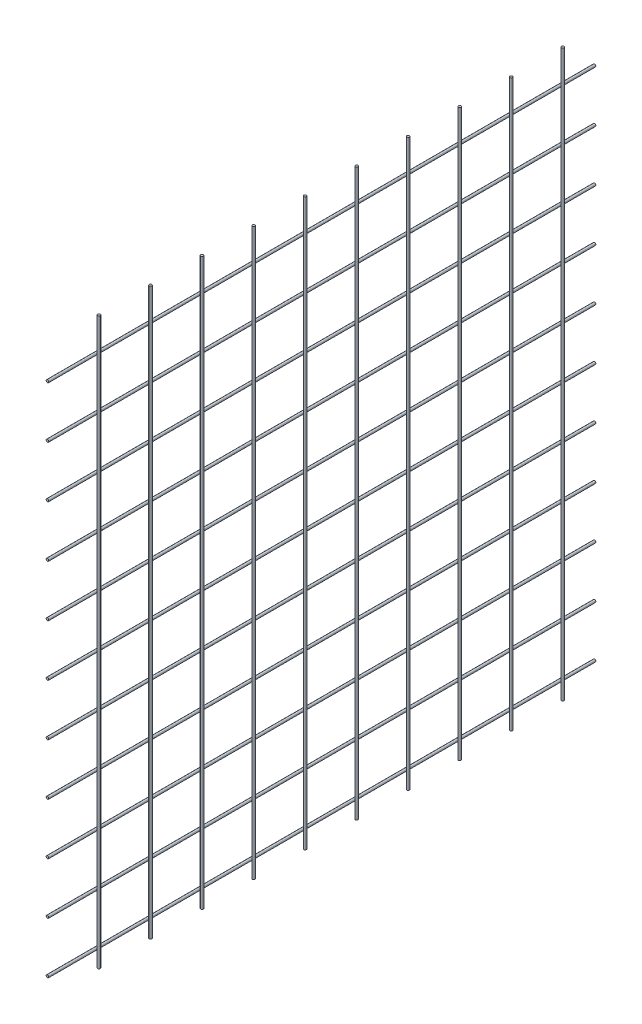
ISO-10303-21;
HEADER;
FILE_DESCRIPTION(('STEP AP214'),'2;1');
FILE_NAME('part.step','',(''),(''),'','','');
FILE_SCHEMA(('AUTOMOTIVE_DESIGN { 1 0 10303 214 1 1 1 1 }'));
ENDSEC;
DATA;
#1=APPLICATION_CONTEXT('core data for automotive mechanical design processes');
#2=APPLICATION_PROTOCOL_DEFINITION('international standard','automotive_design',2000,#1);
#3=PRODUCT_CONTEXT('',#1,'mechanical');
#4=PRODUCT('Part','Part','',(#3));
#5=PRODUCT_RELATED_PRODUCT_CATEGORY('part','',(#4));
#6=PRODUCT_DEFINITION_FORMATION('','',#4);
#7=PRODUCT_DEFINITION_CONTEXT('part definition',#1,'design');
#8=PRODUCT_DEFINITION('design','',#6,#7);
#9=PRODUCT_DEFINITION_SHAPE('','',#8);
#10=(LENGTH_UNIT() NAMED_UNIT(*) SI_UNIT(.MILLI.,.METRE.));
#11=(NAMED_UNIT(*) PLANE_ANGLE_UNIT() SI_UNIT($,.RADIAN.));
#12=(NAMED_UNIT(*) SI_UNIT($,.STERADIAN.) SOLID_ANGLE_UNIT());
#13=UNCERTAINTY_MEASURE_WITH_UNIT(LENGTH_MEASURE(1.E-05),#10,'distance_accuracy_value','');
#14=(GEOMETRIC_REPRESENTATION_CONTEXT(3) GLOBAL_UNCERTAINTY_ASSIGNED_CONTEXT((#13)) GLOBAL_UNIT_ASSIGNED_CONTEXT((#10,
#11,#12)) REPRESENTATION_CONTEXT('',''));
#15=CARTESIAN_POINT('',(0.,0.,0.));
#16=DIRECTION('',(0.,0.,1.));
#17=DIRECTION('',(1.,0.,0.));
#18=AXIS2_PLACEMENT_3D('',#15,#16,#17);
#19=CARTESIAN_POINT('',(3.0000000000043,1980.00200000005,-3000.00000000001));
#20=DIRECTION('',(0.,-1.00000000000002,0.));
#21=DIRECTION('',(0.,0.,-1.));
#22=AXIS2_PLACEMENT_3D('',#19,#20,#21);
#23=CYLINDRICAL_SURFACE('',#22,1.5);
#24=CARTESIAN_POINT('',(3.0000000000043,1940.00000000005,-3000.00000000001));
#25=DIRECTION('',(0.,1.00000000000002,0.));
#26=DIRECTION('',(0.,0.,1.));
#27=AXIS2_PLACEMENT_3D('',#24,#25,#26);
#28=CIRCLE('',#27,1.5);
#29=CARTESIAN_POINT('',(3.0000000000043,1940.00000000005,-2998.50000000001));
#30=VERTEX_POINT('',#29);
#31=EDGE_CURVE('E11',#30,#30,#28,.T.);
#32=ORIENTED_EDGE('',*,*,#31,.F.);
#33=EDGE_LOOP('',(#32));
#34=FACE_BOUND('',#33,.T.);
#35=CARTESIAN_POINT('',(3.0000000000036,1281.50000000003,-3000.));
#36=DIRECTION('',(0.,-1.00000000000002,0.));
#37=DIRECTION('',(0.,0.,-1.));
#38=AXIS2_PLACEMENT_3D('',#35,#36,#37);
#39=CIRCLE('',#38,1.5);
#40=CARTESIAN_POINT('',(3.0000000000036,1281.50000000003,-3001.5));
#41=VERTEX_POINT('',#40);
#42=EDGE_CURVE('E61',#41,#41,#39,.T.);
#43=ORIENTED_EDGE('',*,*,#42,.F.);
#44=EDGE_LOOP('',(#43));
#45=FACE_BOUND('',#44,.T.);
#46=ADVANCED_FACE('F58',(#34,#45),#23,.T.);
#47=CARTESIAN_POINT('',(-15.4999999999939,1940.00000000005,-3060.00000000001));
#48=DIRECTION('',(0.,1.00000000000002,0.));
#49=DIRECTION('',(0.,0.,1.));
#50=AXIS2_PLACEMENT_3D('',#47,#48,#49);
#51=PLANE('',#50);
#52=ORIENTED_EDGE('',*,*,#31,.T.);
#53=EDGE_LOOP('',(#52));
#54=FACE_BOUND('',#53,.T.);
#55=ADVANCED_FACE('F79',(#54),#51,.T.);
#56=CARTESIAN_POINT('',(-20.0099999999955,1281.50000000003,-3040.));
#57=DIRECTION('',(0.,-1.00000000000002,0.));
#58=DIRECTION('',(0.,0.,-1.));
#59=AXIS2_PLACEMENT_3D('',#56,#57,#58);
#60=PLANE('',#59);
#61=ORIENTED_EDGE('',*,*,#42,.T.);
#62=EDGE_LOOP('',(#61));
#63=FACE_BOUND('',#62,.T.);
#64=ADVANCED_FACE('F76',(#63),#60,.T.);
#65=CLOSED_SHELL('',(#46,#55,#64));
#66=MANIFOLD_SOLID_BREP('B2',#65);
#67=CARTESIAN_POINT('',(3.00000000000608,1980.00200000005,-2940.00000000001));
#68=DIRECTION('',(0.,-1.00000000000002,0.));
#69=DIRECTION('',(0.,0.,-1.));
#70=AXIS2_PLACEMENT_3D('',#67,#68,#69);
#71=CYLINDRICAL_SURFACE('',#70,1.5);
#72=CARTESIAN_POINT('',(3.0000000000063,1940.00000000005,-2940.00000000001));
#73=DIRECTION('',(0.,1.00000000000002,0.));
#74=DIRECTION('',(0.,0.,1.));
#75=AXIS2_PLACEMENT_3D('',#72,#73,#74);
#76=CIRCLE('',#75,1.5);
#77=CARTESIAN_POINT('',(3.0000000000063,1940.00000000005,-2938.50000000001));
#78=VERTEX_POINT('',#77);
#79=EDGE_CURVE('E57',#78,#78,#76,.T.);
#80=ORIENTED_EDGE('',*,*,#79,.F.);
#81=EDGE_LOOP('',(#80));
#82=FACE_BOUND('',#81,.T.);
#83=CARTESIAN_POINT('',(3.00000000000449,1281.50000000003,-2940.));
#84=DIRECTION('',(0.,-1.00000000000002,0.));
#85=DIRECTION('',(0.,0.,-1.));
#86=AXIS2_PLACEMENT_3D('',#83,#84,#85);
#87=CIRCLE('',#86,1.5);
#88=CARTESIAN_POINT('',(3.00000000000449,1281.50000000003,-2941.5));
#89=VERTEX_POINT('',#88);
#90=EDGE_CURVE('E110',#89,#89,#87,.T.);
#91=ORIENTED_EDGE('',*,*,#90,.F.);
#92=EDGE_LOOP('',(#91));
#93=FACE_BOUND('',#92,.T.);
#94=ADVANCED_FACE('F107',(#82,#93),#71,.T.);
#95=CARTESIAN_POINT('',(-15.4999999999939,1940.00000000005,-3060.00000000001));
#96=DIRECTION('',(0.,1.00000000000002,0.));
#97=DIRECTION('',(0.,0.,1.));
#98=AXIS2_PLACEMENT_3D('',#95,#96,#97);
#99=PLANE('',#98);
#100=ORIENTED_EDGE('',*,*,#79,.T.);
#101=EDGE_LOOP('',(#100));
#102=FACE_BOUND('',#101,.T.);
#103=ADVANCED_FACE('F127',(#102),#99,.T.);
#104=CARTESIAN_POINT('',(-20.0099999999955,1281.50000000003,-3040.));
#105=DIRECTION('',(0.,-1.00000000000002,0.));
#106=DIRECTION('',(0.,0.,-1.));
#107=AXIS2_PLACEMENT_3D('',#104,#105,#106);
#108=PLANE('',#107);
#109=ORIENTED_EDGE('',*,*,#90,.T.);
#110=EDGE_LOOP('',(#109));
#111=FACE_BOUND('',#110,.T.);
#112=ADVANCED_FACE('F124',(#111),#108,.T.);
#113=CLOSED_SHELL('',(#94,#103,#112));
#114=MANIFOLD_SOLID_BREP('B6',#113);
#115=CARTESIAN_POINT('',(3.00000000000211,1980.00200000004,-2880.00000000001));
#116=DIRECTION('',(0.,-1.00000000000001,0.));
#117=DIRECTION('',(0.,0.,-1.));
#118=AXIS2_PLACEMENT_3D('',#115,#116,#117);
#119=CYLINDRICAL_SURFACE('',#118,1.5);
#120=CARTESIAN_POINT('',(3.00000000000611,1940.00000000004,-2880.00000000001));
#121=DIRECTION('',(0.,1.00000000000001,0.));
#122=DIRECTION('',(0.,0.,1.));
#123=AXIS2_PLACEMENT_3D('',#120,#121,#122);
#124=CIRCLE('',#123,1.5);
#125=CARTESIAN_POINT('',(3.00000000000611,1940.00000000004,-2878.50000000001));
#126=VERTEX_POINT('',#125);
#127=EDGE_CURVE('E106',#126,#126,#124,.T.);
#128=ORIENTED_EDGE('',*,*,#127,.F.);
#129=EDGE_LOOP('',(#128));
#130=FACE_BOUND('',#129,.T.);
#131=CARTESIAN_POINT('',(3.00000000000167,1281.50000000003,-2880.));
#132=DIRECTION('',(0.,-1.00000000000001,0.));
#133=DIRECTION('',(0.,0.,-1.));
#134=AXIS2_PLACEMENT_3D('',#131,#132,#133);
#135=CIRCLE('',#134,1.5);
#136=CARTESIAN_POINT('',(3.00000000000167,1281.50000000003,-2881.5));
#137=VERTEX_POINT('',#136);
#138=EDGE_CURVE('E158',#137,#137,#135,.T.);
#139=ORIENTED_EDGE('',*,*,#138,.F.);
#140=EDGE_LOOP('',(#139));
#141=FACE_BOUND('',#140,.T.);
#142=ADVANCED_FACE('F155',(#130,#141),#119,.T.);
#143=CARTESIAN_POINT('',(-15.4999999999939,1940.00000000004,-3060.00000000001));
#144=DIRECTION('',(0.,1.00000000000001,0.));
#145=DIRECTION('',(0.,0.,1.));
#146=AXIS2_PLACEMENT_3D('',#143,#144,#145);
#147=PLANE('',#146);
#148=ORIENTED_EDGE('',*,*,#127,.T.);
#149=EDGE_LOOP('',(#148));
#150=FACE_BOUND('',#149,.T.);
#151=ADVANCED_FACE('F175',(#150),#147,.T.);
#152=CARTESIAN_POINT('',(-20.0099999999941,1281.50000000003,-3040.00000000001));
#153=DIRECTION('',(0.,-1.00000000000001,0.));
#154=DIRECTION('',(0.,0.,-1.));
#155=AXIS2_PLACEMENT_3D('',#152,#153,#154);
#156=PLANE('',#155);
#157=ORIENTED_EDGE('',*,*,#138,.T.);
#158=EDGE_LOOP('',(#157));
#159=FACE_BOUND('',#158,.T.);
#160=ADVANCED_FACE('F172',(#159),#156,.T.);
#161=CLOSED_SHELL('',(#142,#151,#160));
#162=MANIFOLD_SOLID_BREP('B52',#161);
#163=CARTESIAN_POINT('',(3.00000000000433,1980.00200000004,-2820.00000000001));
#164=DIRECTION('',(0.,-1.00000000000001,0.));
#165=DIRECTION('',(0.,0.,-1.));
#166=AXIS2_PLACEMENT_3D('',#163,#164,#165);
#167=CYLINDRICAL_SURFACE('',#166,1.5);
#168=CARTESIAN_POINT('',(3.00000000000433,1940.00000000004,-2820.00000000001));
#169=DIRECTION('',(0.,1.00000000000001,0.));
#170=DIRECTION('',(0.,0.,1.));
#171=AXIS2_PLACEMENT_3D('',#168,#169,#170);
#172=CIRCLE('',#171,1.5);
#173=CARTESIAN_POINT('',(3.00000000000433,1940.00000000004,-2818.50000000001));
#174=VERTEX_POINT('',#173);
#175=EDGE_CURVE('E154',#174,#174,#172,.T.);
#176=ORIENTED_EDGE('',*,*,#175,.F.);
#177=EDGE_LOOP('',(#176));
#178=FACE_BOUND('',#177,.T.);
#179=CARTESIAN_POINT('',(3.00000000000367,1281.50000000003,-2820.));
#180=DIRECTION('',(0.,-1.00000000000001,0.));
#181=DIRECTION('',(0.,0.,-1.));
#182=AXIS2_PLACEMENT_3D('',#179,#180,#181);
#183=CIRCLE('',#182,1.5);
#184=CARTESIAN_POINT('',(3.00000000000367,1281.50000000003,-2821.5));
#185=VERTEX_POINT('',#184);
#186=EDGE_CURVE('E206',#185,#185,#183,.T.);
#187=ORIENTED_EDGE('',*,*,#186,.F.);
#188=EDGE_LOOP('',(#187));
#189=FACE_BOUND('',#188,.T.);
#190=ADVANCED_FACE('F203',(#178,#189),#167,.T.);
#191=CARTESIAN_POINT('',(-15.4999999999939,1940.00000000004,-3060.00000000001));
#192=DIRECTION('',(0.,1.00000000000001,0.));
#193=DIRECTION('',(0.,0.,1.));
#194=AXIS2_PLACEMENT_3D('',#191,#192,#193);
#195=PLANE('',#194);
#196=ORIENTED_EDGE('',*,*,#175,.T.);
#197=EDGE_LOOP('',(#196));
#198=FACE_BOUND('',#197,.T.);
#199=ADVANCED_FACE('F223',(#198),#195,.T.);
#200=CARTESIAN_POINT('',(-20.0099999999941,1281.50000000003,-3040.00000000001));
#201=DIRECTION('',(0.,-1.00000000000001,0.));
#202=DIRECTION('',(0.,0.,-1.));
#203=AXIS2_PLACEMENT_3D('',#200,#201,#202);
#204=PLANE('',#203);
#205=ORIENTED_EDGE('',*,*,#186,.T.);
#206=EDGE_LOOP('',(#205));
#207=FACE_BOUND('',#206,.T.);
#208=ADVANCED_FACE('F220',(#207),#204,.T.);
#209=CLOSED_SHELL('',(#190,#199,#208));
#210=MANIFOLD_SOLID_BREP('B101',#209);
#211=CARTESIAN_POINT('',(3.00000000000411,1980.00200000004,-2760.00000000001));
#212=DIRECTION('',(0.,-1.00000000000001,0.));
#213=DIRECTION('',(0.,0.,-1.));
#214=AXIS2_PLACEMENT_3D('',#211,#212,#213);
#215=CYLINDRICAL_SURFACE('',#214,1.5);
#216=CARTESIAN_POINT('',(3.00000000000433,1940.00000000004,-2760.00000000001));
#217=DIRECTION('',(0.,1.00000000000001,0.));
#218=DIRECTION('',(0.,0.,1.));
#219=AXIS2_PLACEMENT_3D('',#216,#217,#218);
#220=CIRCLE('',#219,1.5);
#221=CARTESIAN_POINT('',(3.00000000000433,1940.00000000004,-2758.50000000001));
#222=VERTEX_POINT('',#221);
#223=EDGE_CURVE('E202',#222,#222,#220,.T.);
#224=ORIENTED_EDGE('',*,*,#223,.F.);
#225=EDGE_LOOP('',(#224));
#226=FACE_BOUND('',#225,.T.);
#227=CARTESIAN_POINT('',(3.00000000000367,1281.50000000003,-2760.));
#228=DIRECTION('',(0.,-1.00000000000001,0.));
#229=DIRECTION('',(0.,0.,-1.));
#230=AXIS2_PLACEMENT_3D('',#227,#228,#229);
#231=CIRCLE('',#230,1.5);
#232=CARTESIAN_POINT('',(3.00000000000367,1281.50000000003,-2761.5));
#233=VERTEX_POINT('',#232);
#234=EDGE_CURVE('E254',#233,#233,#231,.T.);
#235=ORIENTED_EDGE('',*,*,#234,.F.);
#236=EDGE_LOOP('',(#235));
#237=FACE_BOUND('',#236,.T.);
#238=ADVANCED_FACE('F251',(#226,#237),#215,.T.);
#239=CARTESIAN_POINT('',(-15.4999999999939,1940.00000000004,-3060.00000000001));
#240=DIRECTION('',(0.,1.00000000000001,0.));
#241=DIRECTION('',(0.,0.,1.));
#242=AXIS2_PLACEMENT_3D('',#239,#240,#241);
#243=PLANE('',#242);
#244=ORIENTED_EDGE('',*,*,#223,.T.);
#245=EDGE_LOOP('',(#244));
#246=FACE_BOUND('',#245,.T.);
#247=ADVANCED_FACE('F271',(#246),#243,.T.);
#248=CARTESIAN_POINT('',(-20.0099999999941,1281.50000000003,-3040.00000000001));
#249=DIRECTION('',(0.,-1.00000000000001,0.));
#250=DIRECTION('',(0.,0.,-1.));
#251=AXIS2_PLACEMENT_3D('',#248,#249,#250);
#252=PLANE('',#251);
#253=ORIENTED_EDGE('',*,*,#234,.T.);
#254=EDGE_LOOP('',(#253));
#255=FACE_BOUND('',#254,.T.);
#256=ADVANCED_FACE('F268',(#255),#252,.T.);
#257=CLOSED_SHELL('',(#238,#247,#256));
#258=MANIFOLD_SOLID_BREP('B149',#257);
#259=CARTESIAN_POINT('',(3.00000000000233,1980.00200000004,-2700.00000000001));
#260=DIRECTION('',(0.,-1.00000000000001,0.));
#261=DIRECTION('',(0.,0.,-1.));
#262=AXIS2_PLACEMENT_3D('',#259,#260,#261);
#263=CYLINDRICAL_SURFACE('',#262,1.5);
#264=CARTESIAN_POINT('',(3.00000000000633,1940.00000000004,-2700.00000000001));
#265=DIRECTION('',(0.,1.00000000000001,0.));
#266=DIRECTION('',(0.,0.,1.));
#267=AXIS2_PLACEMENT_3D('',#264,#265,#266);
#268=CIRCLE('',#267,1.5);
#269=CARTESIAN_POINT('',(3.00000000000633,1940.00000000004,-2698.50000000001));
#270=VERTEX_POINT('',#269);
#271=EDGE_CURVE('E250',#270,#270,#268,.T.);
#272=ORIENTED_EDGE('',*,*,#271,.F.);
#273=EDGE_LOOP('',(#272));
#274=FACE_BOUND('',#273,.T.);
#275=CARTESIAN_POINT('',(3.00000000000189,1281.50000000003,-2700.));
#276=DIRECTION('',(0.,-1.00000000000001,0.));
#277=DIRECTION('',(0.,0.,-1.));
#278=AXIS2_PLACEMENT_3D('',#275,#276,#277);
#279=CIRCLE('',#278,1.5);
#280=CARTESIAN_POINT('',(3.00000000000189,1281.50000000003,-2701.5));
#281=VERTEX_POINT('',#280);
#282=EDGE_CURVE('E302',#281,#281,#279,.T.);
#283=ORIENTED_EDGE('',*,*,#282,.F.);
#284=EDGE_LOOP('',(#283));
#285=FACE_BOUND('',#284,.T.);
#286=ADVANCED_FACE('F299',(#274,#285),#263,.T.);
#287=CARTESIAN_POINT('',(-15.4999999999939,1940.00000000004,-3060.00000000001));
#288=DIRECTION('',(0.,1.00000000000001,0.));
#289=DIRECTION('',(0.,0.,1.));
#290=AXIS2_PLACEMENT_3D('',#287,#288,#289);
#291=PLANE('',#290);
#292=ORIENTED_EDGE('',*,*,#271,.T.);
#293=EDGE_LOOP('',(#292));
#294=FACE_BOUND('',#293,.T.);
#295=ADVANCED_FACE('F319',(#294),#291,.T.);
#296=CARTESIAN_POINT('',(-20.0099999999941,1281.50000000003,-3040.00000000001));
#297=DIRECTION('',(0.,-1.00000000000001,0.));
#298=DIRECTION('',(0.,0.,-1.));
#299=AXIS2_PLACEMENT_3D('',#296,#297,#298);
#300=PLANE('',#299);
#301=ORIENTED_EDGE('',*,*,#282,.T.);
#302=EDGE_LOOP('',(#301));
#303=FACE_BOUND('',#302,.T.);
#304=ADVANCED_FACE('F316',(#303),#300,.T.);
#305=CLOSED_SHELL('',(#286,#295,#304));
#306=MANIFOLD_SOLID_BREP('B197',#305);
#307=CARTESIAN_POINT('',(3.00000000000211,1980.00200000004,-2640.00000000001));
#308=DIRECTION('',(0.,-1.00000000000001,0.));
#309=DIRECTION('',(0.,0.,-1.));
#310=AXIS2_PLACEMENT_3D('',#307,#308,#309);
#311=CYLINDRICAL_SURFACE('',#310,1.5);
#312=CARTESIAN_POINT('',(3.00000000000233,1940.00000000004,-2640.00000000001));
#313=DIRECTION('',(0.,1.00000000000001,0.));
#314=DIRECTION('',(0.,0.,1.));
#315=AXIS2_PLACEMENT_3D('',#312,#313,#314);
#316=CIRCLE('',#315,1.5);
#317=CARTESIAN_POINT('',(3.00000000000233,1940.00000000004,-2638.50000000001));
#318=VERTEX_POINT('',#317);
#319=EDGE_CURVE('E298',#318,#318,#316,.T.);
#320=ORIENTED_EDGE('',*,*,#319,.F.);
#321=EDGE_LOOP('',(#320));
#322=FACE_BOUND('',#321,.T.);
#323=CARTESIAN_POINT('',(3.00000000000189,1281.50000000003,-2640.));
#324=DIRECTION('',(0.,-1.00000000000001,0.));
#325=DIRECTION('',(0.,0.,-1.));
#326=AXIS2_PLACEMENT_3D('',#323,#324,#325);
#327=CIRCLE('',#326,1.5);
#328=CARTESIAN_POINT('',(3.00000000000189,1281.50000000003,-2641.5));
#329=VERTEX_POINT('',#328);
#330=EDGE_CURVE('E350',#329,#329,#327,.T.);
#331=ORIENTED_EDGE('',*,*,#330,.F.);
#332=EDGE_LOOP('',(#331));
#333=FACE_BOUND('',#332,.T.);
#334=ADVANCED_FACE('F347',(#322,#333),#311,.T.);
#335=CARTESIAN_POINT('',(-15.4999999999939,1940.00000000004,-3060.00000000001));
#336=DIRECTION('',(0.,1.00000000000001,0.));
#337=DIRECTION('',(0.,0.,1.));
#338=AXIS2_PLACEMENT_3D('',#335,#336,#337);
#339=PLANE('',#338);
#340=ORIENTED_EDGE('',*,*,#319,.T.);
#341=EDGE_LOOP('',(#340));
#342=FACE_BOUND('',#341,.T.);
#343=ADVANCED_FACE('F367',(#342),#339,.T.);
#344=CARTESIAN_POINT('',(-20.0099999999941,1281.50000000003,-3040.00000000001));
#345=DIRECTION('',(0.,-1.00000000000001,0.));
#346=DIRECTION('',(0.,0.,-1.));
#347=AXIS2_PLACEMENT_3D('',#344,#345,#346);
#348=PLANE('',#347);
#349=ORIENTED_EDGE('',*,*,#330,.T.);
#350=EDGE_LOOP('',(#349));
#351=FACE_BOUND('',#350,.T.);
#352=ADVANCED_FACE('F364',(#351),#348,.T.);
#353=CLOSED_SHELL('',(#334,#343,#352));
#354=MANIFOLD_SOLID_BREP('B245',#353);
#355=CARTESIAN_POINT('',(3.00000000000411,1980.00200000004,-2580.00000000001));
#356=DIRECTION('',(0.,-1.00000000000001,0.));
#357=DIRECTION('',(0.,0.,-1.));
#358=AXIS2_PLACEMENT_3D('',#355,#356,#357);
#359=CYLINDRICAL_SURFACE('',#358,1.5);
#360=CARTESIAN_POINT('',(3.00000000000433,1940.00000000004,-2580.00000000001));
#361=DIRECTION('',(0.,1.00000000000001,0.));
#362=DIRECTION('',(0.,0.,1.));
#363=AXIS2_PLACEMENT_3D('',#360,#361,#362);
#364=CIRCLE('',#363,1.5);
#365=CARTESIAN_POINT('',(3.00000000000433,1940.00000000004,-2578.50000000001));
#366=VERTEX_POINT('',#365);
#367=EDGE_CURVE('E346',#366,#366,#364,.T.);
#368=ORIENTED_EDGE('',*,*,#367,.F.);
#369=EDGE_LOOP('',(#368));
#370=FACE_BOUND('',#369,.T.);
#371=CARTESIAN_POINT('',(3.00000000000389,1281.50000000003,-2580.));
#372=DIRECTION('',(0.,-1.00000000000001,0.));
#373=DIRECTION('',(0.,0.,-1.));
#374=AXIS2_PLACEMENT_3D('',#371,#372,#373);
#375=CIRCLE('',#374,1.5);
#376=CARTESIAN_POINT('',(3.00000000000389,1281.50000000003,-2581.5));
#377=VERTEX_POINT('',#376);
#378=EDGE_CURVE('E398',#377,#377,#375,.T.);
#379=ORIENTED_EDGE('',*,*,#378,.F.);
#380=EDGE_LOOP('',(#379));
#381=FACE_BOUND('',#380,.T.);
#382=ADVANCED_FACE('F395',(#370,#381),#359,.T.);
#383=CARTESIAN_POINT('',(-15.4999999999939,1940.00000000004,-3060.00000000001));
#384=DIRECTION('',(0.,1.00000000000001,0.));
#385=DIRECTION('',(0.,0.,1.));
#386=AXIS2_PLACEMENT_3D('',#383,#384,#385);
#387=PLANE('',#386);
#388=ORIENTED_EDGE('',*,*,#367,.T.);
#389=EDGE_LOOP('',(#388));
#390=FACE_BOUND('',#389,.T.);
#391=ADVANCED_FACE('F416',(#390),#387,.T.);
#392=CARTESIAN_POINT('',(-20.0099999999941,1281.50000000003,-3040.00000000001));
#393=DIRECTION('',(0.,-1.00000000000001,0.));
#394=DIRECTION('',(0.,0.,-1.));
#395=AXIS2_PLACEMENT_3D('',#392,#393,#394);
#396=PLANE('',#395);
#397=ORIENTED_EDGE('',*,*,#378,.T.);
#398=EDGE_LOOP('',(#397));
#399=FACE_BOUND('',#398,.T.);
#400=ADVANCED_FACE('F413',(#399),#396,.T.);
#401=CLOSED_SHELL('',(#382,#391,#400));
#402=MANIFOLD_SOLID_BREP('B293',#401);
#403=CARTESIAN_POINT('',(3.00000000000633,1980.00200000004,-2520.00000000001));
#404=DIRECTION('',(0.,-1.00000000000001,0.));
#405=DIRECTION('',(0.,0.,-1.));
#406=AXIS2_PLACEMENT_3D('',#403,#404,#405);
#407=CYLINDRICAL_SURFACE('',#406,1.5);
#408=CARTESIAN_POINT('',(3.00000000000633,1940.00000000004,-2520.00000000001));
#409=DIRECTION('',(0.,1.00000000000001,0.));
#410=DIRECTION('',(0.,0.,1.));
#411=AXIS2_PLACEMENT_3D('',#408,#409,#410);
#412=CIRCLE('',#411,1.5);
#413=CARTESIAN_POINT('',(3.00000000000633,1940.00000000004,-2518.50000000001));
#414=VERTEX_POINT('',#413);
#415=EDGE_CURVE('E394',#414,#414,#412,.T.);
#416=ORIENTED_EDGE('',*,*,#415,.F.);
#417=EDGE_LOOP('',(#416));
#418=FACE_BOUND('',#417,.T.);
#419=CARTESIAN_POINT('',(3.00000000000189,1281.50000000003,-2520.));
#420=DIRECTION('',(0.,-1.00000000000001,0.));
#421=DIRECTION('',(0.,0.,-1.));
#422=AXIS2_PLACEMENT_3D('',#419,#420,#421);
#423=CIRCLE('',#422,1.5);
#424=CARTESIAN_POINT('',(3.00000000000189,1281.50000000003,-2521.5));
#425=VERTEX_POINT('',#424);
#426=EDGE_CURVE('E447',#425,#425,#423,.T.);
#427=ORIENTED_EDGE('',*,*,#426,.F.);
#428=EDGE_LOOP('',(#427));
#429=FACE_BOUND('',#428,.T.);
#430=ADVANCED_FACE('F444',(#418,#429),#407,.T.);
#431=CARTESIAN_POINT('',(-15.4999999999939,1940.00000000004,-3060.00000000001));
#432=DIRECTION('',(0.,1.00000000000001,0.));
#433=DIRECTION('',(0.,0.,1.));
#434=AXIS2_PLACEMENT_3D('',#431,#432,#433);
#435=PLANE('',#434);
#436=ORIENTED_EDGE('',*,*,#415,.T.);
#437=EDGE_LOOP('',(#436));
#438=FACE_BOUND('',#437,.T.);
#439=ADVANCED_FACE('F465',(#438),#435,.T.);
#440=CARTESIAN_POINT('',(-20.0099999999941,1281.50000000003,-3040.00000000001));
#441=DIRECTION('',(0.,-1.00000000000001,0.));
#442=DIRECTION('',(0.,0.,-1.));
#443=AXIS2_PLACEMENT_3D('',#440,#441,#442);
#444=PLANE('',#443);
#445=ORIENTED_EDGE('',*,*,#426,.T.);
#446=EDGE_LOOP('',(#445));
#447=FACE_BOUND('',#446,.T.);
#448=ADVANCED_FACE('F462',(#447),#444,.T.);
#449=CLOSED_SHELL('',(#430,#439,#448));
#450=MANIFOLD_SOLID_BREP('B341',#449);
#451=CARTESIAN_POINT('',(3.00000000000233,1980.00200000004,-2460.00000000001));
#452=DIRECTION('',(0.,-1.00000000000001,0.));
#453=DIRECTION('',(0.,0.,-1.));
#454=AXIS2_PLACEMENT_3D('',#451,#452,#453);
#455=CYLINDRICAL_SURFACE('',#454,1.5);
#456=CARTESIAN_POINT('',(3.00000000000633,1940.00000000004,-2460.00000000001));
#457=DIRECTION('',(0.,1.00000000000001,0.));
#458=DIRECTION('',(0.,0.,1.));
#459=AXIS2_PLACEMENT_3D('',#456,#457,#458);
#460=CIRCLE('',#459,1.5);
#461=CARTESIAN_POINT('',(3.00000000000633,1940.00000000004,-2458.50000000001));
#462=VERTEX_POINT('',#461);
#463=EDGE_CURVE('E443',#462,#462,#460,.T.);
#464=ORIENTED_EDGE('',*,*,#463,.F.);
#465=EDGE_LOOP('',(#464));
#466=FACE_BOUND('',#465,.T.);
#467=CARTESIAN_POINT('',(3.00000000000189,1281.50000000003,-2460.));
#468=DIRECTION('',(0.,-1.00000000000001,0.));
#469=DIRECTION('',(0.,0.,-1.));
#470=AXIS2_PLACEMENT_3D('',#467,#468,#469);
#471=CIRCLE('',#470,1.5);
#472=CARTESIAN_POINT('',(3.00000000000189,1281.50000000003,-2461.5));
#473=VERTEX_POINT('',#472);
#474=EDGE_CURVE('E496',#473,#473,#471,.T.);
#475=ORIENTED_EDGE('',*,*,#474,.F.);
#476=EDGE_LOOP('',(#475));
#477=FACE_BOUND('',#476,.T.);
#478=ADVANCED_FACE('F493',(#466,#477),#455,.T.);
#479=CARTESIAN_POINT('',(-15.4999999999939,1940.00000000004,-3060.00000000001));
#480=DIRECTION('',(0.,1.00000000000001,0.));
#481=DIRECTION('',(0.,0.,1.));
#482=AXIS2_PLACEMENT_3D('',#479,#480,#481);
#483=PLANE('',#482);
#484=ORIENTED_EDGE('',*,*,#463,.T.);
#485=EDGE_LOOP('',(#484));
#486=FACE_BOUND('',#485,.T.);
#487=ADVANCED_FACE('F514',(#486),#483,.T.);
#488=CARTESIAN_POINT('',(-20.0099999999941,1281.50000000003,-3040.00000000001));
#489=DIRECTION('',(0.,-1.00000000000001,0.));
#490=DIRECTION('',(0.,0.,-1.));
#491=AXIS2_PLACEMENT_3D('',#488,#489,#490);
#492=PLANE('',#491);
#493=ORIENTED_EDGE('',*,*,#474,.T.);
#494=EDGE_LOOP('',(#493));
#495=FACE_BOUND('',#494,.T.);
#496=ADVANCED_FACE('F511',(#495),#492,.T.);
#497=CLOSED_SHELL('',(#478,#487,#496));
#498=MANIFOLD_SOLID_BREP('B389',#497);
#499=CARTESIAN_POINT('',(4.36976843598558E-12,1300.00000000003,-3080.002));
#500=DIRECTION('',(0.,0.,1.));
#501=DIRECTION('',(0.999999999999992,0.,0.));
#502=AXIS2_PLACEMENT_3D('',#499,#500,#501);
#503=CYLINDRICAL_SURFACE('',#502,1.49999999999989);
#504=CARTESIAN_POINT('',(5.92581539393677E-12,1300.00000000003,-3040.));
#505=DIRECTION('',(0.,0.,-1.));
#506=DIRECTION('',(-0.999999999999992,0.,0.));
#507=AXIS2_PLACEMENT_3D('',#504,#505,#506);
#508=CIRCLE('',#507,1.49999999999989);
#509=CARTESIAN_POINT('',(-1.49999999999395,1300.00000000003,-3040.));
#510=VERTEX_POINT('',#509);
#511=EDGE_CURVE('E492',#510,#510,#508,.T.);
#512=ORIENTED_EDGE('',*,*,#511,.F.);
#513=EDGE_LOOP('',(#512));
#514=FACE_BOUND('',#513,.T.);
#515=CARTESIAN_POINT('',(3.9569042487031E-12,1300.00000000003,-2403.));
#516=DIRECTION('',(0.,0.,1.));
#517=DIRECTION('',(0.999999999999992,0.,0.));
#518=AXIS2_PLACEMENT_3D('',#515,#516,#517);
#519=CIRCLE('',#518,1.49999999999989);
#520=CARTESIAN_POINT('',(1.50000000000383,1300.00000000003,-2403.));
#521=VERTEX_POINT('',#520);
#522=EDGE_CURVE('E545',#521,#521,#519,.T.);
#523=ORIENTED_EDGE('',*,*,#522,.F.);
#524=EDGE_LOOP('',(#523));
#525=FACE_BOUND('',#524,.T.);
#526=ADVANCED_FACE('F542',(#514,#525),#503,.T.);
#527=CARTESIAN_POINT('',(-15.4999999999991,1.64070146357886E-11,-3040.));
#528=DIRECTION('',(0.,0.,-1.));
#529=DIRECTION('',(-0.999999999999992,0.,0.));
#530=AXIS2_PLACEMENT_3D('',#527,#528,#529);
#531=PLANE('',#530);
#532=ORIENTED_EDGE('',*,*,#511,.T.);
#533=EDGE_LOOP('',(#532));
#534=FACE_BOUND('',#533,.T.);
#535=ADVANCED_FACE('F563',(#534),#531,.T.);
#536=CARTESIAN_POINT('',(-20.0099999999956,1940.00000000004,-2403.));
#537=DIRECTION('',(0.,0.,1.));
#538=DIRECTION('',(0.999999999999992,0.,0.));
#539=AXIS2_PLACEMENT_3D('',#536,#537,#538);
#540=PLANE('',#539);
#541=ORIENTED_EDGE('',*,*,#522,.T.);
#542=EDGE_LOOP('',(#541));
#543=FACE_BOUND('',#542,.T.);
#544=ADVANCED_FACE('F560',(#543),#540,.T.);
#545=CLOSED_SHELL('',(#526,#535,#544));
#546=MANIFOLD_SOLID_BREP('B438',#545);
#547=CARTESIAN_POINT('',(1.54390389361936E-13,1360.00000000004,-3080.002));
#548=DIRECTION('',(0.,0.,1.));
#549=DIRECTION('',(0.999999999999992,0.,0.));
#550=AXIS2_PLACEMENT_3D('',#547,#548,#549);
#551=CYLINDRICAL_SURFACE('',#550,1.49999999999989);
#552=CARTESIAN_POINT('',(1.4883927423881E-12,1360.00000000004,-3040.));
#553=DIRECTION('',(0.,0.,-1.));
#554=DIRECTION('',(-0.999999999999992,0.,0.));
#555=AXIS2_PLACEMENT_3D('',#552,#553,#554);
#556=CIRCLE('',#555,1.49999999999989);
#557=CARTESIAN_POINT('',(-1.49999999999839,1360.00000000004,-3040.));
#558=VERTEX_POINT('',#557);
#559=EDGE_CURVE('E541',#558,#558,#556,.T.);
#560=ORIENTED_EDGE('',*,*,#559,.F.);
#561=EDGE_LOOP('',(#560));
#562=FACE_BOUND('',#561,.T.);
#563=CARTESIAN_POINT('',(-4.80518402845576E-13,1360.00000000003,-2403.));
#564=DIRECTION('',(0.,0.,1.));
#565=DIRECTION('',(0.999999999999992,0.,0.));
#566=AXIS2_PLACEMENT_3D('',#563,#564,#565);
#567=CIRCLE('',#566,1.49999999999989);
#568=CARTESIAN_POINT('',(1.49999999999939,1360.00000000003,-2403.));
#569=VERTEX_POINT('',#568);
#570=EDGE_CURVE('E597',#569,#569,#567,.T.);
#571=ORIENTED_EDGE('',*,*,#570,.F.);
#572=EDGE_LOOP('',(#571));
#573=FACE_BOUND('',#572,.T.);
#574=ADVANCED_FACE('F594',(#562,#573),#551,.T.);
#575=CARTESIAN_POINT('',(-15.4999999999991,1.65180369382512E-11,-3040.));
#576=DIRECTION('',(0.,0.,-1.));
#577=DIRECTION('',(-0.999999999999992,0.,0.));
#578=AXIS2_PLACEMENT_3D('',#575,#576,#577);
#579=PLANE('',#578);
#580=ORIENTED_EDGE('',*,*,#559,.T.);
#581=EDGE_LOOP('',(#580));
#582=FACE_BOUND('',#581,.T.);
#583=ADVANCED_FACE('F615',(#582),#579,.T.);
#584=CARTESIAN_POINT('',(-20.0099999999956,1940.00000000004,-2403.));
#585=DIRECTION('',(0.,0.,1.));
#586=DIRECTION('',(0.999999999999992,0.,0.));
#587=AXIS2_PLACEMENT_3D('',#584,#585,#586);
#588=PLANE('',#587);
#589=ORIENTED_EDGE('',*,*,#570,.T.);
#590=EDGE_LOOP('',(#589));
#591=FACE_BOUND('',#590,.T.);
#592=ADVANCED_FACE('F612',(#591),#588,.T.);
#593=CLOSED_SHELL('',(#574,#583,#592));
#594=MANIFOLD_SOLID_BREP('B487',#593);
#595=CARTESIAN_POINT('',(1.57859836313889E-13,1420.00000000004,-3080.002));
#596=DIRECTION('',(0.,0.,1.));
#597=DIRECTION('',(0.999999999999992,0.,0.));
#598=AXIS2_PLACEMENT_3D('',#595,#596,#597);
#599=CYLINDRICAL_SURFACE('',#598,1.49999999999989);
#600=CARTESIAN_POINT('',(1.49186218934005E-12,1420.00000000004,-3040.));
#601=DIRECTION('',(0.,0.,-1.));
#602=DIRECTION('',(-0.999999999999992,0.,0.));
#603=AXIS2_PLACEMENT_3D('',#600,#601,#602);
#604=CIRCLE('',#603,1.49999999999989);
#605=CARTESIAN_POINT('',(-1.49999999999838,1420.00000000004,-3040.));
#606=VERTEX_POINT('',#605);
#607=EDGE_CURVE('E593',#606,#606,#604,.T.);
#608=ORIENTED_EDGE('',*,*,#607,.F.);
#609=EDGE_LOOP('',(#608));
#610=FACE_BOUND('',#609,.T.);
#611=CARTESIAN_POINT('',(-2.55004350968591E-13,1420.00000000003,-2403.));
#612=DIRECTION('',(0.,0.,1.));
#613=DIRECTION('',(0.999999999999992,0.,0.));
#614=AXIS2_PLACEMENT_3D('',#611,#612,#613);
#615=CIRCLE('',#614,1.49999999999989);
#616=CARTESIAN_POINT('',(1.49999999999962,1420.00000000003,-2403.));
#617=VERTEX_POINT('',#616);
#618=EDGE_CURVE('E652',#617,#617,#615,.T.);
#619=ORIENTED_EDGE('',*,*,#618,.F.);
#620=EDGE_LOOP('',(#619));
#621=FACE_BOUND('',#620,.T.);
#622=ADVANCED_FACE('F649',(#610,#621),#599,.T.);
#623=CARTESIAN_POINT('',(-15.4999999999991,1.67400815431762E-11,-3040.));
#624=DIRECTION('',(0.,0.,-1.));
#625=DIRECTION('',(-0.999999999999992,0.,0.));
#626=AXIS2_PLACEMENT_3D('',#623,#624,#625);
#627=PLANE('',#626);
#628=ORIENTED_EDGE('',*,*,#607,.T.);
#629=EDGE_LOOP('',(#628));
#630=FACE_BOUND('',#629,.T.);
#631=ADVANCED_FACE('F670',(#630),#627,.T.);
#632=CARTESIAN_POINT('',(-20.0099999999956,1940.00000000004,-2403.));
#633=DIRECTION('',(0.,0.,1.));
#634=DIRECTION('',(0.999999999999992,0.,0.));
#635=AXIS2_PLACEMENT_3D('',#632,#633,#634);
#636=PLANE('',#635);
#637=ORIENTED_EDGE('',*,*,#618,.T.);
#638=EDGE_LOOP('',(#637));
#639=FACE_BOUND('',#638,.T.);
#640=ADVANCED_FACE('F667',(#639),#636,.T.);
#641=CLOSED_SHELL('',(#622,#631,#640));
#642=MANIFOLD_SOLID_BREP('B536',#641);
#643=CARTESIAN_POINT('',(1.61329283265843E-13,1480.00000000003,-3080.002));
#644=DIRECTION('',(0.,0.,1.));
#645=DIRECTION('',(0.999999999999992,0.,0.));
#646=AXIS2_PLACEMENT_3D('',#643,#644,#645);
#647=CYLINDRICAL_SURFACE('',#646,1.49999999999989);
#648=CARTESIAN_POINT('',(1.49533163629201E-12,1480.00000000003,-3040.));
#649=DIRECTION('',(0.,0.,-1.));
#650=DIRECTION('',(-0.999999999999992,0.,0.));
#651=AXIS2_PLACEMENT_3D('',#648,#649,#650);
#652=CIRCLE('',#651,1.49999999999989);
#653=CARTESIAN_POINT('',(-1.49999999999838,1480.00000000003,-3040.));
#654=VERTEX_POINT('',#653);
#655=EDGE_CURVE('E648',#654,#654,#652,.T.);
#656=ORIENTED_EDGE('',*,*,#655,.F.);
#657=EDGE_LOOP('',(#656));
#658=FACE_BOUND('',#657,.T.);
#659=CARTESIAN_POINT('',(-2.51534904016637E-13,1480.00000000003,-2403.));
#660=DIRECTION('',(0.,0.,1.));
#661=DIRECTION('',(0.999999999999992,0.,0.));
#662=AXIS2_PLACEMENT_3D('',#659,#660,#661);
#663=CIRCLE('',#662,1.49999999999989);
#664=CARTESIAN_POINT('',(1.49999999999962,1480.00000000003,-2403.));
#665=VERTEX_POINT('',#664);
#666=EDGE_CURVE('E701',#665,#665,#663,.T.);
#667=ORIENTED_EDGE('',*,*,#666,.F.);
#668=EDGE_LOOP('',(#667));
#669=FACE_BOUND('',#668,.T.);
#670=ADVANCED_FACE('F698',(#658,#669),#647,.T.);
#671=CARTESIAN_POINT('',(-15.4999999999991,1.66290592407137E-11,-3040.));
#672=DIRECTION('',(0.,0.,-1.));
#673=DIRECTION('',(-0.999999999999992,0.,0.));
#674=AXIS2_PLACEMENT_3D('',#671,#672,#673);
#675=PLANE('',#674);
#676=ORIENTED_EDGE('',*,*,#655,.T.);
#677=EDGE_LOOP('',(#676));
#678=FACE_BOUND('',#677,.T.);
#679=ADVANCED_FACE('F719',(#678),#675,.T.);
#680=CARTESIAN_POINT('',(-20.0099999999956,1940.00000000004,-2403.));
#681=DIRECTION('',(0.,0.,1.));
#682=DIRECTION('',(0.999999999999992,0.,0.));
#683=AXIS2_PLACEMENT_3D('',#680,#681,#682);
#684=PLANE('',#683);
#685=ORIENTED_EDGE('',*,*,#666,.T.);
#686=EDGE_LOOP('',(#685));
#687=FACE_BOUND('',#686,.T.);
#688=ADVANCED_FACE('F716',(#687),#684,.T.);
#689=CLOSED_SHELL('',(#670,#679,#688));
#690=MANIFOLD_SOLID_BREP('B588',#689);
#691=CARTESIAN_POINT('',(1.49706635976798E-12,1540.00000000004,-3080.002));
#692=DIRECTION('',(0.,0.,1.));
#693=DIRECTION('',(0.999999999999992,0.,0.));
#694=AXIS2_PLACEMENT_3D('',#691,#692,#693);
#695=CYLINDRICAL_SURFACE('',#694,1.49999999999989);
#696=CARTESIAN_POINT('',(1.49880108324396E-12,1540.00000000004,-3040.));
#697=DIRECTION('',(0.,0.,-1.));
#698=DIRECTION('',(-0.999999999999992,0.,0.));
#699=AXIS2_PLACEMENT_3D('',#696,#697,#698);
#700=CIRCLE('',#699,1.49999999999989);
#701=CARTESIAN_POINT('',(-1.49999999999838,1540.00000000004,-3040.));
#702=VERTEX_POINT('',#701);
#703=EDGE_CURVE('E697',#702,#702,#700,.T.);
#704=ORIENTED_EDGE('',*,*,#703,.F.);
#705=EDGE_LOOP('',(#704));
#706=FACE_BOUND('',#705,.T.);
#707=CARTESIAN_POINT('',(-2.48065457064683E-13,1540.00000000004,-2403.));
#708=DIRECTION('',(0.,0.,1.));
#709=DIRECTION('',(0.999999999999992,0.,0.));
#710=AXIS2_PLACEMENT_3D('',#707,#708,#709);
#711=CIRCLE('',#710,1.49999999999989);
#712=CARTESIAN_POINT('',(1.49999999999963,1540.00000000004,-2403.));
#713=VERTEX_POINT('',#712);
#714=EDGE_CURVE('E750',#713,#713,#711,.T.);
#715=ORIENTED_EDGE('',*,*,#714,.F.);
#716=EDGE_LOOP('',(#715));
#717=FACE_BOUND('',#716,.T.);
#718=ADVANCED_FACE('F747',(#706,#717),#695,.T.);
#719=CARTESIAN_POINT('',(-15.4999999999991,1.66290592407137E-11,-3040.));
#720=DIRECTION('',(0.,0.,-1.));
#721=DIRECTION('',(-0.999999999999992,0.,0.));
#722=AXIS2_PLACEMENT_3D('',#719,#720,#721);
#723=PLANE('',#722);
#724=ORIENTED_EDGE('',*,*,#703,.T.);
#725=EDGE_LOOP('',(#724));
#726=FACE_BOUND('',#725,.T.);
#727=ADVANCED_FACE('F768',(#726),#723,.T.);
#728=CARTESIAN_POINT('',(-20.0099999999956,1940.00000000004,-2403.));
#729=DIRECTION('',(0.,0.,1.));
#730=DIRECTION('',(0.999999999999992,0.,0.));
#731=AXIS2_PLACEMENT_3D('',#728,#729,#730);
#732=PLANE('',#731);
#733=ORIENTED_EDGE('',*,*,#714,.T.);
#734=EDGE_LOOP('',(#733));
#735=FACE_BOUND('',#734,.T.);
#736=ADVANCED_FACE('F765',(#735),#732,.T.);
#737=CLOSED_SHELL('',(#718,#727,#736));
#738=MANIFOLD_SOLID_BREP('B643',#737);
#739=CARTESIAN_POINT('',(1.49880108324396E-12,1600.00000000004,-3080.00200000001));
#740=DIRECTION('',(0.,0.,1.));
#741=DIRECTION('',(0.999999999999992,0.,0.));
#742=AXIS2_PLACEMENT_3D('',#739,#740,#741);
#743=CYLINDRICAL_SURFACE('',#742,1.49999999999989);
#744=CARTESIAN_POINT('',(1.72258041164497E-12,1600.00000000004,-3040.00000000001));
#745=DIRECTION('',(0.,0.,-1.));
#746=DIRECTION('',(-0.999999999999992,0.,0.));
#747=AXIS2_PLACEMENT_3D('',#744,#745,#746);
#748=CIRCLE('',#747,1.49999999999989);
#749=CARTESIAN_POINT('',(-1.49999999999815,1600.00000000004,-3040.00000000001));
#750=VERTEX_POINT('',#749);
#751=EDGE_CURVE('E746',#750,#750,#748,.T.);
#752=ORIENTED_EDGE('',*,*,#751,.F.);
#753=EDGE_LOOP('',(#752));
#754=FACE_BOUND('',#753,.T.);
#755=CARTESIAN_POINT('',(-2.46330733588707E-13,1600.00000000004,-2403.00000000001));
#756=DIRECTION('',(0.,0.,1.));
#757=DIRECTION('',(0.999999999999992,0.,0.));
#758=AXIS2_PLACEMENT_3D('',#755,#756,#757);
#759=CIRCLE('',#758,1.49999999999989);
#760=CARTESIAN_POINT('',(1.49999999999963,1600.00000000004,-2403.00000000001));
#761=VERTEX_POINT('',#760);
#762=EDGE_CURVE('E799',#761,#761,#759,.T.);
#763=ORIENTED_EDGE('',*,*,#762,.F.);
#764=EDGE_LOOP('',(#763));
#765=FACE_BOUND('',#764,.T.);
#766=ADVANCED_FACE('F796',(#754,#765),#743,.T.);
#767=CARTESIAN_POINT('',(-15.4999999999991,1.65180369382512E-11,-3040.));
#768=DIRECTION('',(0.,0.,-1.));
#769=DIRECTION('',(-0.999999999999992,0.,0.));
#770=AXIS2_PLACEMENT_3D('',#767,#768,#769);
#771=PLANE('',#770);
#772=ORIENTED_EDGE('',*,*,#751,.T.);
#773=EDGE_LOOP('',(#772));
#774=FACE_BOUND('',#773,.T.);
#775=ADVANCED_FACE('F817',(#774),#771,.T.);
#776=CARTESIAN_POINT('',(-20.0099999999956,1940.00000000004,-2403.));
#777=DIRECTION('',(0.,0.,1.));
#778=DIRECTION('',(0.999999999999992,0.,0.));
#779=AXIS2_PLACEMENT_3D('',#776,#777,#778);
#780=PLANE('',#779);
#781=ORIENTED_EDGE('',*,*,#762,.T.);
#782=EDGE_LOOP('',(#781));
#783=FACE_BOUND('',#782,.T.);
#784=ADVANCED_FACE('F814',(#783),#780,.T.);
#785=CLOSED_SHELL('',(#766,#775,#784));
#786=MANIFOLD_SOLID_BREP('B692',#785);
#787=CARTESIAN_POINT('',(1.50227053019591E-12,1660.00000000005,-3080.00200000001));
#788=DIRECTION('',(0.,0.,1.));
#789=DIRECTION('',(0.999999999999992,0.,0.));
#790=AXIS2_PLACEMENT_3D('',#787,#788,#789);
#791=CYLINDRICAL_SURFACE('',#790,1.49999999999989);
#792=CARTESIAN_POINT('',(1.72604985859692E-12,1660.00000000005,-3040.00000000001));
#793=DIRECTION('',(0.,0.,-1.));
#794=DIRECTION('',(-0.999999999999992,0.,0.));
#795=AXIS2_PLACEMENT_3D('',#792,#793,#794);
#796=CIRCLE('',#795,1.49999999999989);
#797=CARTESIAN_POINT('',(-1.49999999999815,1660.00000000005,-3040.00000000001));
#798=VERTEX_POINT('',#797);
#799=EDGE_CURVE('E795',#798,#798,#796,.T.);
#800=ORIENTED_EDGE('',*,*,#799,.F.);
#801=EDGE_LOOP('',(#800));
#802=FACE_BOUND('',#801,.T.);
#803=CARTESIAN_POINT('',(-2.42861286636753E-13,1660.00000000004,-2403.00000000001));
#804=DIRECTION('',(0.,0.,1.));
#805=DIRECTION('',(0.999999999999992,0.,0.));
#806=AXIS2_PLACEMENT_3D('',#803,#804,#805);
#807=CIRCLE('',#806,1.49999999999989);
#808=CARTESIAN_POINT('',(1.49999999999963,1660.00000000004,-2403.00000000001));
#809=VERTEX_POINT('',#808);
#810=EDGE_CURVE('E848',#809,#809,#807,.T.);
#811=ORIENTED_EDGE('',*,*,#810,.F.);
#812=EDGE_LOOP('',(#811));
#813=FACE_BOUND('',#812,.T.);
#814=ADVANCED_FACE('F845',(#802,#813),#791,.T.);
#815=CARTESIAN_POINT('',(-15.4999999999991,1.66290592407137E-11,-3040.));
#816=DIRECTION('',(0.,0.,-1.));
#817=DIRECTION('',(-0.999999999999992,0.,0.));
#818=AXIS2_PLACEMENT_3D('',#815,#816,#817);
#819=PLANE('',#818);
#820=ORIENTED_EDGE('',*,*,#799,.T.);
#821=EDGE_LOOP('',(#820));
#822=FACE_BOUND('',#821,.T.);
#823=ADVANCED_FACE('F866',(#822),#819,.T.);
#824=CARTESIAN_POINT('',(-20.0099999999956,1940.00000000004,-2403.));
#825=DIRECTION('',(0.,0.,1.));
#826=DIRECTION('',(0.999999999999992,0.,0.));
#827=AXIS2_PLACEMENT_3D('',#824,#825,#826);
#828=PLANE('',#827);
#829=ORIENTED_EDGE('',*,*,#810,.T.);
#830=EDGE_LOOP('',(#829));
#831=FACE_BOUND('',#830,.T.);
#832=ADVANCED_FACE('F863',(#831),#828,.T.);
#833=CLOSED_SHELL('',(#814,#823,#832));
#834=MANIFOLD_SOLID_BREP('B741',#833);
#835=CARTESIAN_POINT('',(1.7277845820729E-12,1720.00000000004,-3080.00200000001));
#836=DIRECTION('',(0.,0.,1.));
#837=DIRECTION('',(0.999999999999992,0.,0.));
#838=AXIS2_PLACEMENT_3D('',#835,#836,#837);
#839=CYLINDRICAL_SURFACE('',#838,1.49999999999989);
#840=CARTESIAN_POINT('',(1.72951930554888E-12,1720.00000000004,-3040.00000000001));
#841=DIRECTION('',(0.,0.,-1.));
#842=DIRECTION('',(-0.999999999999992,0.,0.));
#843=AXIS2_PLACEMENT_3D('',#840,#841,#842);
#844=CIRCLE('',#843,1.49999999999989);
#845=CARTESIAN_POINT('',(-1.49999999999815,1720.00000000004,-3040.00000000001));
#846=VERTEX_POINT('',#845);
#847=EDGE_CURVE('E844',#846,#846,#844,.T.);
#848=ORIENTED_EDGE('',*,*,#847,.F.);
#849=EDGE_LOOP('',(#848));
#850=FACE_BOUND('',#849,.T.);
#851=CARTESIAN_POINT('',(0.,1720.00000000004,-2403.00000000001));
#852=DIRECTION('',(0.,0.,1.));
#853=DIRECTION('',(0.999999999999992,0.,0.));
#854=AXIS2_PLACEMENT_3D('',#851,#852,#853);
#855=CIRCLE('',#854,1.49999999999989);
#856=CARTESIAN_POINT('',(1.49999999999986,1720.00000000004,-2403.00000000001));
#857=VERTEX_POINT('',#856);
#858=EDGE_CURVE('E897',#857,#857,#855,.T.);
#859=ORIENTED_EDGE('',*,*,#858,.F.);
#860=EDGE_LOOP('',(#859));
#861=FACE_BOUND('',#860,.T.);
#862=ADVANCED_FACE('F894',(#850,#861),#839,.T.);
#863=CARTESIAN_POINT('',(-15.4999999999991,1.65180369382512E-11,-3040.));
#864=DIRECTION('',(0.,0.,-1.));
#865=DIRECTION('',(-0.999999999999992,0.,0.));
#866=AXIS2_PLACEMENT_3D('',#863,#864,#865);
#867=PLANE('',#866);
#868=ORIENTED_EDGE('',*,*,#847,.T.);
#869=EDGE_LOOP('',(#868));
#870=FACE_BOUND('',#869,.T.);
#871=ADVANCED_FACE('F915',(#870),#867,.T.);
#872=CARTESIAN_POINT('',(-20.0099999999956,1940.00000000004,-2403.));
#873=DIRECTION('',(0.,0.,1.));
#874=DIRECTION('',(0.999999999999992,0.,0.));
#875=AXIS2_PLACEMENT_3D('',#872,#873,#874);
#876=PLANE('',#875);
#877=ORIENTED_EDGE('',*,*,#858,.T.);
#878=EDGE_LOOP('',(#877));
#879=FACE_BOUND('',#878,.T.);
#880=ADVANCED_FACE('F912',(#879),#876,.T.);
#881=CLOSED_SHELL('',(#862,#871,#880));
#882=MANIFOLD_SOLID_BREP('B790',#881);
#883=CARTESIAN_POINT('',(1.73125402902485E-12,1780.00000000005,-3080.00200000001));
#884=DIRECTION('',(0.,0.,1.));
#885=DIRECTION('',(0.999999999999992,0.,0.));
#886=AXIS2_PLACEMENT_3D('',#883,#884,#885);
#887=CYLINDRICAL_SURFACE('',#886,1.49999999999989);
#888=CARTESIAN_POINT('',(1.73298875250083E-12,1780.00000000005,-3040.00000000001));
#889=DIRECTION('',(0.,0.,-1.));
#890=DIRECTION('',(-0.999999999999992,0.,0.));
#891=AXIS2_PLACEMENT_3D('',#888,#889,#890);
#892=CIRCLE('',#891,1.49999999999989);
#893=CARTESIAN_POINT('',(-1.49999999999814,1780.00000000005,-3040.00000000001));
#894=VERTEX_POINT('',#893);
#895=EDGE_CURVE('E893',#894,#894,#892,.T.);
#896=ORIENTED_EDGE('',*,*,#895,.F.);
#897=EDGE_LOOP('',(#896));
#898=FACE_BOUND('',#897,.T.);
#899=CARTESIAN_POINT('',(0.,1780.00000000005,-2403.00000000001));
#900=DIRECTION('',(0.,0.,1.));
#901=DIRECTION('',(0.999999999999992,0.,0.));
#902=AXIS2_PLACEMENT_3D('',#899,#900,#901);
#903=CIRCLE('',#902,1.49999999999989);
#904=CARTESIAN_POINT('',(1.49999999999986,1780.00000000005,-2403.00000000001));
#905=VERTEX_POINT('',#904);
#906=EDGE_CURVE('E946',#905,#905,#903,.T.);
#907=ORIENTED_EDGE('',*,*,#906,.F.);
#908=EDGE_LOOP('',(#907));
#909=FACE_BOUND('',#908,.T.);
#910=ADVANCED_FACE('F943',(#898,#909),#887,.T.);
#911=CARTESIAN_POINT('',(-15.4999999999991,1.66290592407137E-11,-3040.));
#912=DIRECTION('',(0.,0.,-1.));
#913=DIRECTION('',(-0.999999999999992,0.,0.));
#914=AXIS2_PLACEMENT_3D('',#911,#912,#913);
#915=PLANE('',#914);
#916=ORIENTED_EDGE('',*,*,#895,.T.);
#917=EDGE_LOOP('',(#916));
#918=FACE_BOUND('',#917,.T.);
#919=ADVANCED_FACE('F963',(#918),#915,.T.);
#920=CARTESIAN_POINT('',(-20.0099999999956,1940.00000000004,-2403.));
#921=DIRECTION('',(0.,0.,1.));
#922=DIRECTION('',(0.999999999999992,0.,0.));
#923=AXIS2_PLACEMENT_3D('',#920,#921,#922);
#924=PLANE('',#923);
#925=ORIENTED_EDGE('',*,*,#906,.T.);
#926=EDGE_LOOP('',(#925));
#927=FACE_BOUND('',#926,.T.);
#928=ADVANCED_FACE('F960',(#927),#924,.T.);
#929=CLOSED_SHELL('',(#910,#919,#928));
#930=MANIFOLD_SOLID_BREP('B839',#929);
#931=CARTESIAN_POINT('',(1.73472347597681E-12,1840.00000000005,-3080.00200000001));
#932=DIRECTION('',(0.,0.,1.));
#933=DIRECTION('',(0.999999999999992,0.,0.));
#934=AXIS2_PLACEMENT_3D('',#931,#932,#933);
#935=CYLINDRICAL_SURFACE('',#934,1.49999999999989);
#936=CARTESIAN_POINT('',(1.73645819945278E-12,1840.00000000005,-3040.00000000001));
#937=DIRECTION('',(0.,0.,-1.));
#938=DIRECTION('',(-0.999999999999992,0.,0.));
#939=AXIS2_PLACEMENT_3D('',#936,#937,#938);
#940=CIRCLE('',#939,1.49999999999989);
#941=CARTESIAN_POINT('',(-1.49999999999814,1840.00000000005,-3040.00000000001));
#942=VERTEX_POINT('',#941);
#943=EDGE_CURVE('E942',#942,#942,#940,.T.);
#944=ORIENTED_EDGE('',*,*,#943,.F.);
#945=EDGE_LOOP('',(#944));
#946=FACE_BOUND('',#945,.T.);
#947=CARTESIAN_POINT('',(0.,1840.00000000005,-2403.00000000001));
#948=DIRECTION('',(0.,0.,1.));
#949=DIRECTION('',(0.999999999999992,0.,0.));
#950=AXIS2_PLACEMENT_3D('',#947,#948,#949);
#951=CIRCLE('',#950,1.49999999999989);
#952=CARTESIAN_POINT('',(1.49999999999986,1840.00000000005,-2403.00000000001));
#953=VERTEX_POINT('',#952);
#954=EDGE_CURVE('E993',#953,#953,#951,.T.);
#955=ORIENTED_EDGE('',*,*,#954,.F.);
#956=EDGE_LOOP('',(#955));
#957=FACE_BOUND('',#956,.T.);
#958=ADVANCED_FACE('F990',(#946,#957),#935,.T.);
#959=CARTESIAN_POINT('',(-15.4999999999991,1.66290592407137E-11,-3040.));
#960=DIRECTION('',(0.,0.,-1.));
#961=DIRECTION('',(-0.999999999999992,0.,0.));
#962=AXIS2_PLACEMENT_3D('',#959,#960,#961);
#963=PLANE('',#962);
#964=ORIENTED_EDGE('',*,*,#943,.T.);
#965=EDGE_LOOP('',(#964));
#966=FACE_BOUND('',#965,.T.);
#967=ADVANCED_FACE('F1011',(#966),#963,.T.);
#968=CARTESIAN_POINT('',(-20.0099999999956,1940.00000000004,-2403.));
#969=DIRECTION('',(0.,0.,1.));
#970=DIRECTION('',(0.999999999999992,0.,0.));
#971=AXIS2_PLACEMENT_3D('',#968,#969,#970);
#972=PLANE('',#971);
#973=ORIENTED_EDGE('',*,*,#954,.T.);
#974=EDGE_LOOP('',(#973));
#975=FACE_BOUND('',#974,.T.);
#976=ADVANCED_FACE('F1008',(#975),#972,.T.);
#977=CLOSED_SHELL('',(#958,#967,#976));
#978=MANIFOLD_SOLID_BREP('B888',#977);
#979=CARTESIAN_POINT('',(1.73819292292876E-12,1900.00000000005,-3080.00200000001));
#980=DIRECTION('',(0.,0.,1.));
#981=DIRECTION('',(0.999999999999992,0.,0.));
#982=AXIS2_PLACEMENT_3D('',#979,#980,#981);
#983=CYLINDRICAL_SURFACE('',#982,1.49999999999989);
#984=CARTESIAN_POINT('',(1.96197225132977E-12,1900.00000000005,-3040.00000000001));
#985=DIRECTION('',(0.,0.,-1.));
#986=DIRECTION('',(-0.999999999999992,0.,0.));
#987=AXIS2_PLACEMENT_3D('',#984,#985,#986);
#988=CIRCLE('',#987,1.49999999999989);
#989=CARTESIAN_POINT('',(-1.49999999999791,1900.00000000005,-3040.00000000001));
#990=VERTEX_POINT('',#989);
#991=EDGE_CURVE('E989',#990,#990,#988,.T.);
#992=ORIENTED_EDGE('',*,*,#991,.F.);
#993=EDGE_LOOP('',(#992));
#994=FACE_BOUND('',#993,.T.);
#995=CARTESIAN_POINT('',(0.,1900.00000000005,-2403.00000000001));
#996=DIRECTION('',(0.,0.,1.));
#997=DIRECTION('',(0.999999999999992,0.,0.));
#998=AXIS2_PLACEMENT_3D('',#995,#996,#997);
#999=CIRCLE('',#998,1.49999999999989);
#1000=CARTESIAN_POINT('',(1.49999999999987,1900.00000000005,-2403.00000000001));
#1001=VERTEX_POINT('',#1000);
#1002=EDGE_CURVE('E1034',#1001,#1001,#999,.T.);
#1003=ORIENTED_EDGE('',*,*,#1002,.F.);
#1004=EDGE_LOOP('',(#1003));
#1005=FACE_BOUND('',#1004,.T.);
#1006=ADVANCED_FACE('F1031',(#994,#1005),#983,.T.);
#1007=CARTESIAN_POINT('',(-15.4999999999991,1.65180369382512E-11,-3040.));
#1008=DIRECTION('',(0.,0.,-1.));
#1009=DIRECTION('',(-0.999999999999992,0.,0.));
#1010=AXIS2_PLACEMENT_3D('',#1007,#1008,#1009);
#1011=PLANE('',#1010);
#1012=ORIENTED_EDGE('',*,*,#991,.T.);
#1013=EDGE_LOOP('',(#1012));
#1014=FACE_BOUND('',#1013,.T.);
#1015=ADVANCED_FACE('F1052',(#1014),#1011,.T.);
#1016=CARTESIAN_POINT('',(-20.0099999999956,1940.00000000004,-2403.));
#1017=DIRECTION('',(0.,0.,1.));
#1018=DIRECTION('',(0.999999999999992,0.,0.));
#1019=AXIS2_PLACEMENT_3D('',#1016,#1017,#1018);
#1020=PLANE('',#1019);
#1021=ORIENTED_EDGE('',*,*,#1002,.T.);
#1022=EDGE_LOOP('',(#1021));
#1023=FACE_BOUND('',#1022,.T.);
#1024=ADVANCED_FACE('F1049',(#1023),#1020,.T.);
#1025=CLOSED_SHELL('',(#1006,#1015,#1024));
#1026=MANIFOLD_SOLID_BREP('B937',#1025);
#1027=ADVANCED_BREP_SHAPE_REPRESENTATION('',(#18,#66,#114,#162,#210,#258,#306,#354,#402,#450,
#498,#546,#594,#642,#690,#738,#786,#834,#882,#930,#978,#1026),#14);
#1028=SHAPE_DEFINITION_REPRESENTATION(#9,#1027);
ENDSEC;
END-ISO-10303-21;
